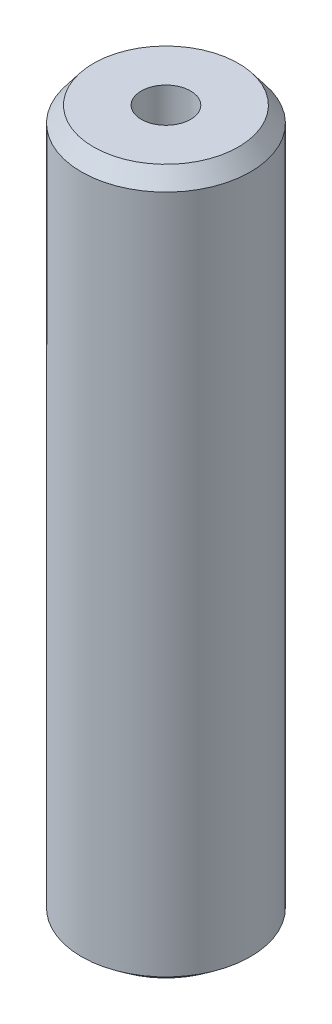
ISO-10303-21;
HEADER;
FILE_DESCRIPTION(('STEP AP214'),'2;1');
FILE_NAME('part.step','',(''),(''),'','','');
FILE_SCHEMA(('AUTOMOTIVE_DESIGN { 1 0 10303 214 1 1 1 1 }'));
ENDSEC;
DATA;
#1=APPLICATION_CONTEXT('core data for automotive mechanical design processes');
#2=APPLICATION_PROTOCOL_DEFINITION('international standard','automotive_design',2000,#1);
#3=PRODUCT_CONTEXT('',#1,'mechanical');
#4=PRODUCT('Part','Part','',(#3));
#5=PRODUCT_RELATED_PRODUCT_CATEGORY('part','',(#4));
#6=PRODUCT_DEFINITION_FORMATION('','',#4);
#7=PRODUCT_DEFINITION_CONTEXT('part definition',#1,'design');
#8=PRODUCT_DEFINITION('design','',#6,#7);
#9=PRODUCT_DEFINITION_SHAPE('','',#8);
#10=(LENGTH_UNIT() NAMED_UNIT(*) SI_UNIT(.MILLI.,.METRE.));
#11=(NAMED_UNIT(*) PLANE_ANGLE_UNIT() SI_UNIT($,.RADIAN.));
#12=(NAMED_UNIT(*) SI_UNIT($,.STERADIAN.) SOLID_ANGLE_UNIT());
#13=UNCERTAINTY_MEASURE_WITH_UNIT(LENGTH_MEASURE(1.E-05),#10,'distance_accuracy_value','');
#14=(GEOMETRIC_REPRESENTATION_CONTEXT(3) GLOBAL_UNCERTAINTY_ASSIGNED_CONTEXT((#13)) GLOBAL_UNIT_ASSIGNED_CONTEXT((#10,
#11,#12)) REPRESENTATION_CONTEXT('',''));
#15=CARTESIAN_POINT('',(0.,0.,0.));
#16=DIRECTION('',(0.,0.,1.));
#17=DIRECTION('',(1.,0.,0.));
#18=AXIS2_PLACEMENT_3D('',#15,#16,#17);
#19=CARTESIAN_POINT('',(0.,209.30815548509,0.));
#20=DIRECTION('',(0.,-1.,0.));
#21=DIRECTION('',(0.,0.,-1.));
#22=AXIS2_PLACEMENT_3D('',#19,#20,#21);
#23=CYLINDRICAL_SURFACE('',#22,25.);
#24=CARTESIAN_POINT('',(0.,204.6861802808,0.));
#25=DIRECTION('',(0.,1.,0.));
#26=DIRECTION('',(0.,0.,1.));
#27=AXIS2_PLACEMENT_3D('',#24,#25,#26);
#28=CIRCLE('',#27,25.);
#29=CARTESIAN_POINT('',(0.,204.6861802808,25.));
#30=VERTEX_POINT('',#29);
#31=EDGE_CURVE('E50',#30,#30,#28,.F.);
#32=ORIENTED_EDGE('',*,*,#31,.T.);
#33=EDGE_LOOP('',(#32));
#34=FACE_BOUND('',#33,.T.);
#35=CARTESIAN_POINT('',(0.,3.55312918089379,0.));
#36=DIRECTION('',(0.,1.,0.));
#37=DIRECTION('',(0.,0.,1.));
#38=AXIS2_PLACEMENT_3D('',#35,#36,#37);
#39=CIRCLE('',#38,25.);
#40=CARTESIAN_POINT('',(0.,3.55312918089379,25.));
#41=VERTEX_POINT('',#40);
#42=EDGE_CURVE('E51',#41,#41,#39,.T.);
#43=ORIENTED_EDGE('',*,*,#42,.T.);
#44=EDGE_LOOP('',(#43));
#45=FACE_BOUND('',#44,.T.);
#46=ADVANCED_FACE('F39',(#34,#45),#23,.T.);
#47=CARTESIAN_POINT('',(0.,209.30815548509,0.));
#48=DIRECTION('',(0.,1.,0.));
#49=DIRECTION('',(0.,0.,1.));
#50=AXIS2_PLACEMENT_3D('',#47,#48,#49);
#51=PLANE('',#50);
#52=CARTESIAN_POINT('',(0.,209.30815548509,0.));
#53=DIRECTION('',(0.,1.,0.));
#54=DIRECTION('',(0.,0.,1.));
#55=AXIS2_PLACEMENT_3D('',#52,#53,#54);
#56=CIRCLE('',#55,21.4468708191063);
#57=CARTESIAN_POINT('',(0.,209.30815548509,21.4468708191063));
#58=VERTEX_POINT('',#57);
#59=EDGE_CURVE('E54',#58,#58,#56,.T.);
#60=ORIENTED_EDGE('',*,*,#59,.T.);
#61=EDGE_LOOP('',(#60));
#62=FACE_BOUND('',#61,.T.);
#63=CARTESIAN_POINT('',(0.,209.30815548509,0.));
#64=DIRECTION('',(0.,1.,0.));
#65=DIRECTION('',(0.,0.,1.));
#66=AXIS2_PLACEMENT_3D('',#63,#64,#65);
#67=CIRCLE('',#66,7.2995538986455);
#68=CARTESIAN_POINT('',(0.,209.30815548509,7.2995538986455));
#69=VERTEX_POINT('',#68);
#70=EDGE_CURVE('E58',#69,#69,#67,.T.);
#71=ORIENTED_EDGE('',*,*,#70,.F.);
#72=EDGE_LOOP('',(#71));
#73=FACE_BOUND('',#72,.T.);
#74=ADVANCED_FACE('F69',(#62,#73),#51,.T.);
#75=CARTESIAN_POINT('',(0.,0.,0.));
#76=DIRECTION('',(0.,1.,0.));
#77=DIRECTION('',(0.,0.,1.));
#78=AXIS2_PLACEMENT_3D('',#75,#76,#77);
#79=PLANE('',#78);
#80=CARTESIAN_POINT('',(0.,0.,0.));
#81=DIRECTION('',(0.,1.,0.));
#82=DIRECTION('',(0.,0.,1.));
#83=AXIS2_PLACEMENT_3D('',#80,#81,#82);
#84=CIRCLE('',#83,20.3780247957102);
#85=CARTESIAN_POINT('',(0.,0.,20.3780247957102));
#86=VERTEX_POINT('',#85);
#87=EDGE_CURVE('E10',#86,#86,#84,.F.);
#88=ORIENTED_EDGE('',*,*,#87,.T.);
#89=EDGE_LOOP('',(#88));
#90=FACE_BOUND('',#89,.T.);
#91=CARTESIAN_POINT('',(0.,0.,0.));
#92=DIRECTION('',(0.,1.,0.));
#93=DIRECTION('',(0.,0.,1.));
#94=AXIS2_PLACEMENT_3D('',#91,#92,#93);
#95=CIRCLE('',#94,7.2995538986455);
#96=CARTESIAN_POINT('',(0.,0.,7.2995538986455));
#97=VERTEX_POINT('',#96);
#98=EDGE_CURVE('E63',#97,#97,#95,.T.);
#99=ORIENTED_EDGE('',*,*,#98,.T.);
#100=EDGE_LOOP('',(#99));
#101=FACE_BOUND('',#100,.T.);
#102=ADVANCED_FACE('F75',(#90,#101),#79,.F.);
#103=CARTESIAN_POINT('',(0.,209.30815548509,0.));
#104=DIRECTION('',(0.,-1.,0.));
#105=DIRECTION('',(0.,0.,-1.));
#106=AXIS2_PLACEMENT_3D('',#103,#104,#105);
#107=CYLINDRICAL_SURFACE('',#106,7.2995538986455);
#108=ORIENTED_EDGE('',*,*,#70,.T.);
#109=EDGE_LOOP('',(#108));
#110=FACE_BOUND('',#109,.T.);
#111=ORIENTED_EDGE('',*,*,#98,.F.);
#112=EDGE_LOOP('',(#111));
#113=FACE_BOUND('',#112,.T.);
#114=ADVANCED_FACE('F70',(#110,#113),#107,.F.);
#115=CARTESIAN_POINT('',(0.,209.30815548509,0.));
#116=DIRECTION('',(0.,-1.,0.));
#117=DIRECTION('',(0.,0.,-1.));
#118=AXIS2_PLACEMENT_3D('',#115,#116,#117);
#119=CONICAL_SURFACE('',#118,21.4468708191063,0.655391572572547);
#120=ORIENTED_EDGE('',*,*,#31,.F.);
#121=EDGE_LOOP('',(#120));
#122=FACE_BOUND('',#121,.T.);
#123=ORIENTED_EDGE('',*,*,#59,.F.);
#124=EDGE_LOOP('',(#123));
#125=FACE_BOUND('',#124,.T.);
#126=ADVANCED_FACE('F81',(#122,#125),#119,.T.);
#127=CARTESIAN_POINT('',(0.,3.55312918089379,0.));
#128=DIRECTION('',(0.,1.,0.));
#129=DIRECTION('',(0.,0.,1.));
#130=AXIS2_PLACEMENT_3D('',#127,#128,#129);
#131=CONICAL_SURFACE('',#130,25.,0.915404754222349);
#132=ORIENTED_EDGE('',*,*,#87,.F.);
#133=EDGE_LOOP('',(#132));
#134=FACE_BOUND('',#133,.T.);
#135=ORIENTED_EDGE('',*,*,#42,.F.);
#136=EDGE_LOOP('',(#135));
#137=FACE_BOUND('',#136,.T.);
#138=ADVANCED_FACE('F45',(#134,#137),#131,.T.);
#139=CLOSED_SHELL('',(#46,#74,#102,#114,#126,#138));
#140=MANIFOLD_SOLID_BREP('B2',#139);
#141=ADVANCED_BREP_SHAPE_REPRESENTATION('',(#18,#140),#14);
#142=SHAPE_DEFINITION_REPRESENTATION(#9,#141);
ENDSEC;
END-ISO-10303-21;
